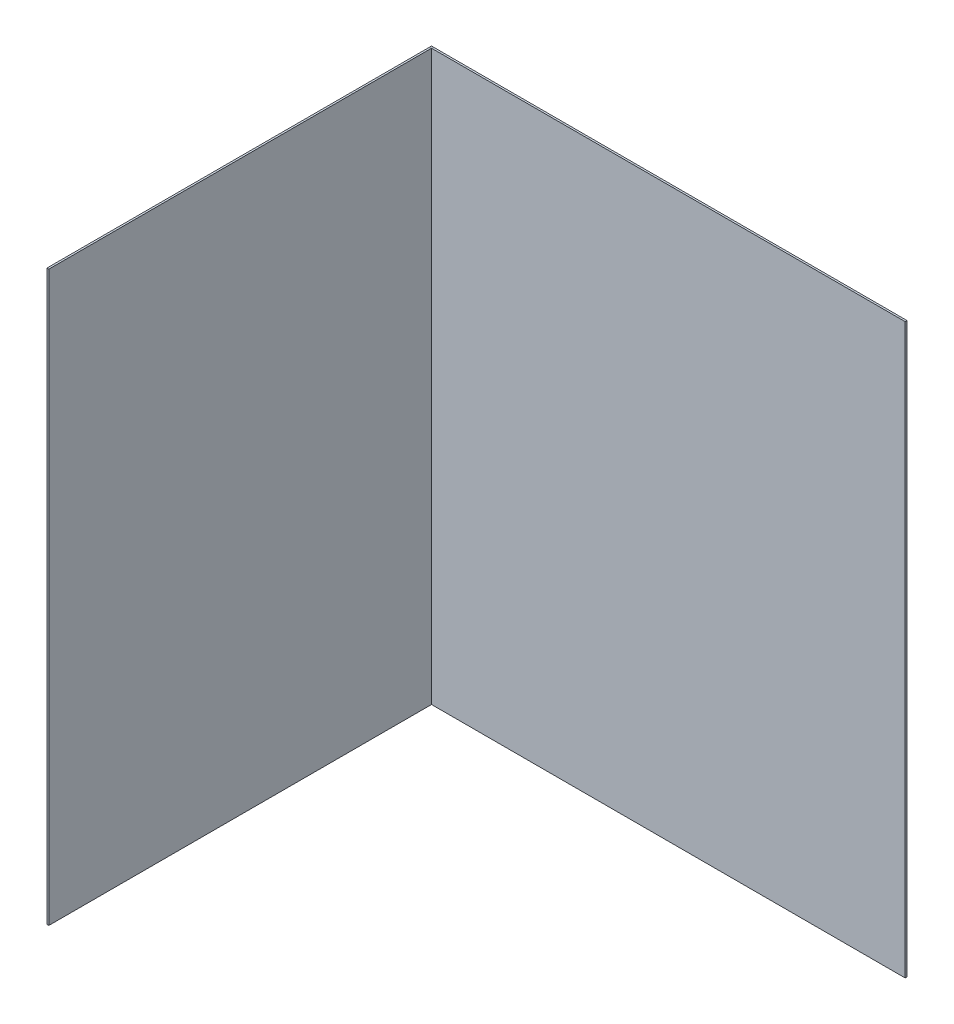
ISO-10303-21;
HEADER;
FILE_DESCRIPTION(('STEP AP214'),'2;1');
FILE_NAME('part.step','',(''),(''),'','','');
FILE_SCHEMA(('AUTOMOTIVE_DESIGN { 1 0 10303 214 1 1 1 1 }'));
ENDSEC;
DATA;
#1=APPLICATION_CONTEXT('core data for automotive mechanical design processes');
#2=APPLICATION_PROTOCOL_DEFINITION('international standard','automotive_design',2000,#1);
#3=PRODUCT_CONTEXT('',#1,'mechanical');
#4=PRODUCT('Part','Part','',(#3));
#5=PRODUCT_RELATED_PRODUCT_CATEGORY('part','',(#4));
#6=PRODUCT_DEFINITION_FORMATION('','',#4);
#7=PRODUCT_DEFINITION_CONTEXT('part definition',#1,'design');
#8=PRODUCT_DEFINITION('design','',#6,#7);
#9=PRODUCT_DEFINITION_SHAPE('','',#8);
#10=(LENGTH_UNIT() NAMED_UNIT(*) SI_UNIT(.MILLI.,.METRE.));
#11=(NAMED_UNIT(*) PLANE_ANGLE_UNIT() SI_UNIT($,.RADIAN.));
#12=(NAMED_UNIT(*) SI_UNIT($,.STERADIAN.) SOLID_ANGLE_UNIT());
#13=UNCERTAINTY_MEASURE_WITH_UNIT(LENGTH_MEASURE(1.E-05),#10,'distance_accuracy_value','');
#14=(GEOMETRIC_REPRESENTATION_CONTEXT(3) GLOBAL_UNCERTAINTY_ASSIGNED_CONTEXT((#13)) GLOBAL_UNIT_ASSIGNED_CONTEXT((#10,
#11,#12)) REPRESENTATION_CONTEXT('',''));
#15=CARTESIAN_POINT('',(0.,0.,0.));
#16=DIRECTION('',(0.,0.,1.));
#17=DIRECTION('',(1.,0.,0.));
#18=AXIS2_PLACEMENT_3D('',#15,#16,#17);
#19=CARTESIAN_POINT('',(-0.001,0.,0.));
#20=DIRECTION('',(1.,0.,0.));
#21=DIRECTION('',(0.,0.,1.));
#22=AXIS2_PLACEMENT_3D('',#19,#20,#21);
#23=PLANE('',#22);
#24=DIRECTION('',(0.,0.,1.));
#25=VECTOR('',#24,1.);
#26=CARTESIAN_POINT('',(-0.001,0.,0.));
#27=LINE('',#26,#25);
#28=CARTESIAN_POINT('',(-0.001,0.,0.001));
#29=VERTEX_POINT('',#28);
#30=CARTESIAN_POINT('',(-0.001,0.,0.203));
#31=VERTEX_POINT('',#30);
#32=EDGE_CURVE('E87',#29,#31,#27,.T.);
#33=ORIENTED_EDGE('',*,*,#32,.T.);
#34=DIRECTION('',(0.,1.,0.));
#35=VECTOR('',#34,1.);
#36=CARTESIAN_POINT('',(-0.001,0.,0.203));
#37=LINE('',#36,#35);
#38=CARTESIAN_POINT('',(-0.001,0.3,0.203));
#39=VERTEX_POINT('',#38);
#40=EDGE_CURVE('E11',#31,#39,#37,.T.);
#41=ORIENTED_EDGE('',*,*,#40,.T.);
#42=DIRECTION('',(0.,0.,-1.));
#43=VECTOR('',#42,1.);
#44=CARTESIAN_POINT('',(-0.001,0.3,0.203));
#45=LINE('',#44,#43);
#46=CARTESIAN_POINT('',(-0.001,0.3,0.001));
#47=VERTEX_POINT('',#46);
#48=EDGE_CURVE('E70',#39,#47,#45,.T.);
#49=ORIENTED_EDGE('',*,*,#48,.T.);
#50=DIRECTION('',(0.,-1.,0.));
#51=VECTOR('',#50,1.);
#52=CARTESIAN_POINT('',(-0.001,0.3,0.001));
#53=LINE('',#52,#51);
#54=EDGE_CURVE('E153',#47,#29,#53,.T.);
#55=ORIENTED_EDGE('',*,*,#54,.T.);
#56=EDGE_LOOP('',(#33,#41,#49,#55));
#57=FACE_BOUND('',#56,.T.);
#58=ADVANCED_FACE('F16',(#57),#23,.F.);
#59=CARTESIAN_POINT('',(0.,0.,0.203));
#60=DIRECTION('',(0.,0.,-1.));
#61=DIRECTION('',(0.,-1.,0.));
#62=AXIS2_PLACEMENT_3D('',#59,#60,#61);
#63=PLANE('',#62);
#64=DIRECTION('',(-1.,0.,0.));
#65=VECTOR('',#64,1.);
#66=CARTESIAN_POINT('',(0.,0.,0.203));
#67=LINE('',#66,#65);
#68=CARTESIAN_POINT('',(0.,0.,0.203));
#69=VERTEX_POINT('',#68);
#70=EDGE_CURVE('E78',#69,#31,#67,.T.);
#71=ORIENTED_EDGE('',*,*,#70,.F.);
#72=DIRECTION('',(0.,1.,0.));
#73=VECTOR('',#72,1.);
#74=CARTESIAN_POINT('',(0.,0.,0.203));
#75=LINE('',#74,#73);
#76=CARTESIAN_POINT('',(0.,0.3,0.203));
#77=VERTEX_POINT('',#76);
#78=EDGE_CURVE('E81',#69,#77,#75,.T.);
#79=ORIENTED_EDGE('',*,*,#78,.T.);
#80=DIRECTION('',(-1.,0.,0.));
#81=VECTOR('',#80,1.);
#82=CARTESIAN_POINT('',(0.,0.3,0.203));
#83=LINE('',#82,#81);
#84=EDGE_CURVE('E27',#77,#39,#83,.T.);
#85=ORIENTED_EDGE('',*,*,#84,.T.);
#86=ORIENTED_EDGE('',*,*,#40,.F.);
#87=EDGE_LOOP('',(#71,#79,#85,#86));
#88=FACE_BOUND('',#87,.T.);
#89=ADVANCED_FACE('F80',(#88),#63,.F.);
#90=CARTESIAN_POINT('',(0.,0.3,0.203));
#91=DIRECTION('',(0.,-1.,0.));
#92=DIRECTION('',(0.,0.,-1.));
#93=AXIS2_PLACEMENT_3D('',#90,#91,#92);
#94=PLANE('',#93);
#95=DIRECTION('',(0.,0.,-1.));
#96=VECTOR('',#95,1.);
#97=CARTESIAN_POINT('',(0.,0.3,0.203));
#98=LINE('',#97,#96);
#99=CARTESIAN_POINT('',(0.,0.3,0.001));
#100=VERTEX_POINT('',#99);
#101=EDGE_CURVE('E95',#77,#100,#98,.T.);
#102=ORIENTED_EDGE('',*,*,#101,.T.);
#103=DIRECTION('',(-1.,0.,0.));
#104=VECTOR('',#103,1.);
#105=CARTESIAN_POINT('',(0.25,0.3,0.001));
#106=LINE('',#105,#104);
#107=EDGE_CURVE('E111',#100,#47,#106,.T.);
#108=ORIENTED_EDGE('',*,*,#107,.T.);
#109=ORIENTED_EDGE('',*,*,#48,.F.);
#110=ORIENTED_EDGE('',*,*,#84,.F.);
#111=EDGE_LOOP('',(#102,#108,#109,#110));
#112=FACE_BOUND('',#111,.T.);
#113=ADVANCED_FACE('F383',(#112),#94,.F.);
#114=CARTESIAN_POINT('',(-0.001,0.3,0.));
#115=DIRECTION('',(1.,0.,0.));
#116=DIRECTION('',(0.,1.,0.));
#117=AXIS2_PLACEMENT_3D('',#114,#115,#116);
#118=PLANE('',#117);
#119=DIRECTION('',(0.,0.,1.));
#120=VECTOR('',#119,1.);
#121=CARTESIAN_POINT('',(-0.001,0.3,0.));
#122=LINE('',#121,#120);
#123=CARTESIAN_POINT('',(-0.001,0.3,0.));
#124=VERTEX_POINT('',#123);
#125=EDGE_CURVE('E137',#124,#47,#122,.T.);
#126=ORIENTED_EDGE('',*,*,#125,.F.);
#127=DIRECTION('',(0.,-1.,0.));
#128=VECTOR('',#127,1.);
#129=CARTESIAN_POINT('',(-0.001,0.3,0.));
#130=LINE('',#129,#128);
#131=CARTESIAN_POINT('',(-0.001,0.,0.));
#132=VERTEX_POINT('',#131);
#133=EDGE_CURVE('E103',#124,#132,#130,.T.);
#134=ORIENTED_EDGE('',*,*,#133,.T.);
#135=DIRECTION('',(0.,0.,1.));
#136=VECTOR('',#135,1.);
#137=CARTESIAN_POINT('',(-0.001,0.,0.));
#138=LINE('',#137,#136);
#139=EDGE_CURVE('E144',#132,#29,#138,.T.);
#140=ORIENTED_EDGE('',*,*,#139,.T.);
#141=ORIENTED_EDGE('',*,*,#54,.F.);
#142=EDGE_LOOP('',(#126,#134,#140,#141));
#143=FACE_BOUND('',#142,.T.);
#144=ADVANCED_FACE('F374',(#143),#118,.F.);
#145=CARTESIAN_POINT('',(0.,0.,0.));
#146=DIRECTION('',(0.,1.,0.));
#147=DIRECTION('',(1.,0.,0.));
#148=AXIS2_PLACEMENT_3D('',#145,#146,#147);
#149=PLANE('',#148);
#150=DIRECTION('',(0.,0.,1.));
#151=VECTOR('',#150,1.);
#152=CARTESIAN_POINT('',(0.,0.,0.));
#153=LINE('',#152,#151);
#154=CARTESIAN_POINT('',(0.,0.,0.001));
#155=VERTEX_POINT('',#154);
#156=EDGE_CURVE('E92',#155,#69,#153,.T.);
#157=ORIENTED_EDGE('',*,*,#156,.T.);
#158=ORIENTED_EDGE('',*,*,#70,.T.);
#159=ORIENTED_EDGE('',*,*,#32,.F.);
#160=DIRECTION('',(1.,0.,0.));
#161=VECTOR('',#160,1.);
#162=CARTESIAN_POINT('',(-0.001,0.,0.001));
#163=LINE('',#162,#161);
#164=EDGE_CURVE('E100',#29,#155,#163,.T.);
#165=ORIENTED_EDGE('',*,*,#164,.T.);
#166=EDGE_LOOP('',(#157,#158,#159,#165));
#167=FACE_BOUND('',#166,.T.);
#168=ADVANCED_FACE('F98',(#167),#149,.F.);
#169=CARTESIAN_POINT('',(0.,0.,0.));
#170=DIRECTION('',(1.,0.,0.));
#171=DIRECTION('',(0.,0.,1.));
#172=AXIS2_PLACEMENT_3D('',#169,#170,#171);
#173=PLANE('',#172);
#174=ORIENTED_EDGE('',*,*,#156,.F.);
#175=DIRECTION('',(0.,-1.,0.));
#176=VECTOR('',#175,1.);
#177=CARTESIAN_POINT('',(0.,0.,0.001));
#178=LINE('',#177,#176);
#179=EDGE_CURVE('E145',#100,#155,#178,.T.);
#180=ORIENTED_EDGE('',*,*,#179,.F.);
#181=ORIENTED_EDGE('',*,*,#101,.F.);
#182=ORIENTED_EDGE('',*,*,#78,.F.);
#183=EDGE_LOOP('',(#174,#180,#181,#182));
#184=FACE_BOUND('',#183,.T.);
#185=ADVANCED_FACE('F90',(#184),#173,.T.);
#186=CARTESIAN_POINT('',(-0.001,0.,0.));
#187=DIRECTION('',(0.,0.,-1.));
#188=DIRECTION('',(0.,-1.,0.));
#189=AXIS2_PLACEMENT_3D('',#186,#187,#188);
#190=PLANE('',#189);
#191=DIRECTION('',(0.,-1.,0.));
#192=VECTOR('',#191,1.);
#193=CARTESIAN_POINT('',(0.,0.3,0.));
#194=LINE('',#193,#192);
#195=CARTESIAN_POINT('',(0.,0.3,0.));
#196=VERTEX_POINT('',#195);
#197=CARTESIAN_POINT('',(0.,0.,0.));
#198=VERTEX_POINT('',#197);
#199=EDGE_CURVE('E177',#196,#198,#194,.T.);
#200=ORIENTED_EDGE('',*,*,#199,.T.);
#201=DIRECTION('',(-1.,0.,0.));
#202=VECTOR('',#201,1.);
#203=CARTESIAN_POINT('',(0.,0.,0.));
#204=LINE('',#203,#202);
#205=EDGE_CURVE('E167',#198,#132,#204,.T.);
#206=ORIENTED_EDGE('',*,*,#205,.T.);
#207=ORIENTED_EDGE('',*,*,#133,.F.);
#208=DIRECTION('',(-1.,0.,0.));
#209=VECTOR('',#208,1.);
#210=CARTESIAN_POINT('',(0.,0.3,0.));
#211=LINE('',#210,#209);
#212=EDGE_CURVE('E140',#196,#124,#211,.T.);
#213=ORIENTED_EDGE('',*,*,#212,.F.);
#214=EDGE_LOOP('',(#200,#206,#207,#213));
#215=FACE_BOUND('',#214,.T.);
#216=ADVANCED_FACE('F18',(#215),#190,.T.);
#217=CARTESIAN_POINT('',(0.,0.3,0.203));
#218=DIRECTION('',(0.,-1.,0.));
#219=DIRECTION('',(0.,0.,-1.));
#220=AXIS2_PLACEMENT_3D('',#217,#218,#219);
#221=PLANE('',#220);
#222=DIRECTION('',(0.,0.,-1.));
#223=VECTOR('',#222,1.);
#224=CARTESIAN_POINT('',(0.,0.3,0.203));
#225=LINE('',#224,#223);
#226=EDGE_CURVE('E120',#100,#196,#225,.T.);
#227=ORIENTED_EDGE('',*,*,#226,.T.);
#228=ORIENTED_EDGE('',*,*,#212,.T.);
#229=ORIENTED_EDGE('',*,*,#125,.T.);
#230=ORIENTED_EDGE('',*,*,#107,.F.);
#231=EDGE_LOOP('',(#227,#228,#229,#230));
#232=FACE_BOUND('',#231,.T.);
#233=ADVANCED_FACE('F335',(#232),#221,.F.);
#234=CARTESIAN_POINT('',(0.,0.,0.));
#235=DIRECTION('',(0.,1.,0.));
#236=DIRECTION('',(1.,0.,0.));
#237=AXIS2_PLACEMENT_3D('',#234,#235,#236);
#238=PLANE('',#237);
#239=DIRECTION('',(0.,0.,1.));
#240=VECTOR('',#239,1.);
#241=CARTESIAN_POINT('',(0.,0.,0.));
#242=LINE('',#241,#240);
#243=EDGE_CURVE('E133',#198,#155,#242,.T.);
#244=ORIENTED_EDGE('',*,*,#243,.T.);
#245=ORIENTED_EDGE('',*,*,#164,.F.);
#246=ORIENTED_EDGE('',*,*,#139,.F.);
#247=ORIENTED_EDGE('',*,*,#205,.F.);
#248=EDGE_LOOP('',(#244,#245,#246,#247));
#249=FACE_BOUND('',#248,.T.);
#250=ADVANCED_FACE('F197',(#249),#238,.F.);
#251=CARTESIAN_POINT('',(-0.001,0.,0.001));
#252=DIRECTION('',(0.,0.,-1.));
#253=DIRECTION('',(0.,-1.,0.));
#254=AXIS2_PLACEMENT_3D('',#251,#252,#253);
#255=PLANE('',#254);
#256=DIRECTION('',(1.,0.,0.));
#257=VECTOR('',#256,1.);
#258=CARTESIAN_POINT('',(-0.001,0.,0.001));
#259=LINE('',#258,#257);
#260=CARTESIAN_POINT('',(0.25,0.,0.001));
#261=VERTEX_POINT('',#260);
#262=EDGE_CURVE('E129',#155,#261,#259,.T.);
#263=ORIENTED_EDGE('',*,*,#262,.T.);
#264=DIRECTION('',(0.,1.,0.));
#265=VECTOR('',#264,1.);
#266=CARTESIAN_POINT('',(0.25,0.,0.001));
#267=LINE('',#266,#265);
#268=CARTESIAN_POINT('',(0.25,0.3,0.001));
#269=VERTEX_POINT('',#268);
#270=EDGE_CURVE('E118',#261,#269,#267,.T.);
#271=ORIENTED_EDGE('',*,*,#270,.T.);
#272=DIRECTION('',(-1.,0.,0.));
#273=VECTOR('',#272,1.);
#274=CARTESIAN_POINT('',(0.25,0.3,0.001));
#275=LINE('',#274,#273);
#276=EDGE_CURVE('E123',#269,#100,#275,.T.);
#277=ORIENTED_EDGE('',*,*,#276,.T.);
#278=ORIENTED_EDGE('',*,*,#179,.T.);
#279=EDGE_LOOP('',(#263,#271,#277,#278));
#280=FACE_BOUND('',#279,.T.);
#281=ADVANCED_FACE('F188',(#280),#255,.F.);
#282=CARTESIAN_POINT('',(-0.001,0.,0.));
#283=DIRECTION('',(0.,0.,-1.));
#284=DIRECTION('',(0.,-1.,0.));
#285=AXIS2_PLACEMENT_3D('',#282,#283,#284);
#286=PLANE('',#285);
#287=DIRECTION('',(1.,0.,0.));
#288=VECTOR('',#287,1.);
#289=CARTESIAN_POINT('',(-0.001,0.,0.));
#290=LINE('',#289,#288);
#291=CARTESIAN_POINT('',(0.25,0.,0.));
#292=VERTEX_POINT('',#291);
#293=EDGE_CURVE('E126',#198,#292,#290,.T.);
#294=ORIENTED_EDGE('',*,*,#293,.F.);
#295=ORIENTED_EDGE('',*,*,#199,.F.);
#296=DIRECTION('',(-1.,0.,0.));
#297=VECTOR('',#296,1.);
#298=CARTESIAN_POINT('',(0.25,0.3,0.));
#299=LINE('',#298,#297);
#300=CARTESIAN_POINT('',(0.25,0.3,0.));
#301=VERTEX_POINT('',#300);
#302=EDGE_CURVE('E124',#301,#196,#299,.T.);
#303=ORIENTED_EDGE('',*,*,#302,.F.);
#304=DIRECTION('',(0.,1.,0.));
#305=VECTOR('',#304,1.);
#306=CARTESIAN_POINT('',(0.25,0.,0.));
#307=LINE('',#306,#305);
#308=EDGE_CURVE('E119',#292,#301,#307,.T.);
#309=ORIENTED_EDGE('',*,*,#308,.F.);
#310=EDGE_LOOP('',(#294,#295,#303,#309));
#311=FACE_BOUND('',#310,.T.);
#312=ADVANCED_FACE('F304',(#311),#286,.T.);
#313=CARTESIAN_POINT('',(0.25,0.3,0.));
#314=DIRECTION('',(0.,-1.,0.));
#315=DIRECTION('',(0.,0.,-1.));
#316=AXIS2_PLACEMENT_3D('',#313,#314,#315);
#317=PLANE('',#316);
#318=ORIENTED_EDGE('',*,*,#302,.T.);
#319=ORIENTED_EDGE('',*,*,#226,.F.);
#320=ORIENTED_EDGE('',*,*,#276,.F.);
#321=DIRECTION('',(0.,0.,1.));
#322=VECTOR('',#321,1.);
#323=CARTESIAN_POINT('',(0.25,0.3,0.));
#324=LINE('',#323,#322);
#325=EDGE_CURVE('E114',#301,#269,#324,.T.);
#326=ORIENTED_EDGE('',*,*,#325,.F.);
#327=EDGE_LOOP('',(#318,#319,#320,#326));
#328=FACE_BOUND('',#327,.T.);
#329=ADVANCED_FACE('F294',(#328),#317,.F.);
#330=CARTESIAN_POINT('',(-0.001,0.,0.));
#331=DIRECTION('',(0.,1.,0.));
#332=DIRECTION('',(1.,0.,0.));
#333=AXIS2_PLACEMENT_3D('',#330,#331,#332);
#334=PLANE('',#333);
#335=ORIENTED_EDGE('',*,*,#293,.T.);
#336=DIRECTION('',(0.,0.,1.));
#337=VECTOR('',#336,1.);
#338=CARTESIAN_POINT('',(0.25,0.,0.));
#339=LINE('',#338,#337);
#340=EDGE_CURVE('E20',#292,#261,#339,.T.);
#341=ORIENTED_EDGE('',*,*,#340,.T.);
#342=ORIENTED_EDGE('',*,*,#262,.F.);
#343=ORIENTED_EDGE('',*,*,#243,.F.);
#344=EDGE_LOOP('',(#335,#341,#342,#343));
#345=FACE_BOUND('',#344,.T.);
#346=ADVANCED_FACE('F203',(#345),#334,.F.);
#347=CARTESIAN_POINT('',(0.25,0.,0.));
#348=DIRECTION('',(-1.,0.,0.));
#349=DIRECTION('',(0.,0.,1.));
#350=AXIS2_PLACEMENT_3D('',#347,#348,#349);
#351=PLANE('',#350);
#352=ORIENTED_EDGE('',*,*,#340,.F.);
#353=ORIENTED_EDGE('',*,*,#308,.T.);
#354=ORIENTED_EDGE('',*,*,#325,.T.);
#355=ORIENTED_EDGE('',*,*,#270,.F.);
#356=EDGE_LOOP('',(#352,#353,#354,#355));
#357=FACE_BOUND('',#356,.T.);
#358=ADVANCED_FACE('F276',(#357),#351,.F.);
#359=CLOSED_SHELL('',(#58,#89,#113,#144,#168,#185,#216,#233,#250,#281,#312,#329,#346,#358));
#360=MANIFOLD_SOLID_BREP('B1',#359);
#361=ADVANCED_BREP_SHAPE_REPRESENTATION('',(#18,#360),#14);
#362=SHAPE_DEFINITION_REPRESENTATION(#9,#361);
ENDSEC;
END-ISO-10303-21;
